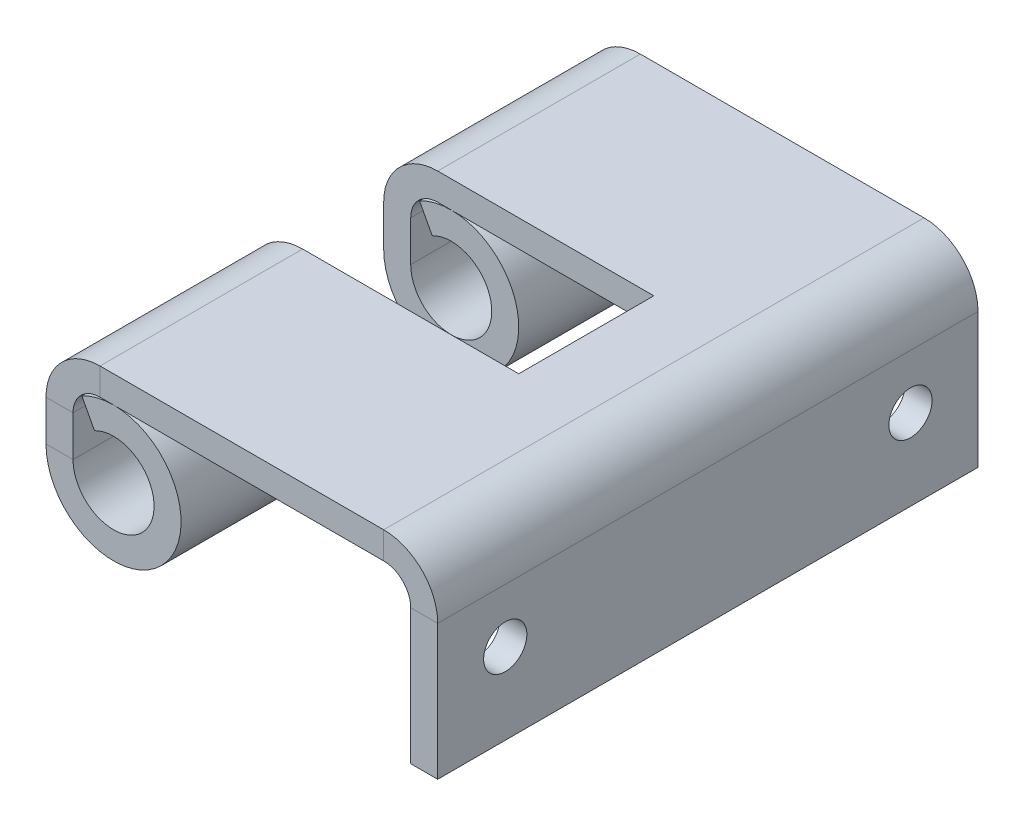
ISO-10303-21;
HEADER;
FILE_DESCRIPTION(('STEP AP214'),'2;1');
FILE_NAME('part.step','',(''),(''),'','','');
FILE_SCHEMA(('AUTOMOTIVE_DESIGN { 1 0 10303 214 1 1 1 1 }'));
ENDSEC;
DATA;
#1=APPLICATION_CONTEXT('core data for automotive mechanical design processes');
#2=APPLICATION_PROTOCOL_DEFINITION('international standard','automotive_design',2000,#1);
#3=PRODUCT_CONTEXT('',#1,'mechanical');
#4=PRODUCT('Part','Part','',(#3));
#5=PRODUCT_RELATED_PRODUCT_CATEGORY('part','',(#4));
#6=PRODUCT_DEFINITION_FORMATION('','',#4);
#7=PRODUCT_DEFINITION_CONTEXT('part definition',#1,'design');
#8=PRODUCT_DEFINITION('design','',#6,#7);
#9=PRODUCT_DEFINITION_SHAPE('','',#8);
#10=(LENGTH_UNIT() NAMED_UNIT(*) SI_UNIT(.MILLI.,.METRE.));
#11=(NAMED_UNIT(*) PLANE_ANGLE_UNIT() SI_UNIT($,.RADIAN.));
#12=(NAMED_UNIT(*) SI_UNIT($,.STERADIAN.) SOLID_ANGLE_UNIT());
#13=UNCERTAINTY_MEASURE_WITH_UNIT(LENGTH_MEASURE(1.E-05),#10,'distance_accuracy_value','');
#14=(GEOMETRIC_REPRESENTATION_CONTEXT(3) GLOBAL_UNCERTAINTY_ASSIGNED_CONTEXT((#13)) GLOBAL_UNIT_ASSIGNED_CONTEXT((#10,
#11,#12)) REPRESENTATION_CONTEXT('',''));
#15=CARTESIAN_POINT('',(0.,0.,0.));
#16=DIRECTION('',(0.,0.,1.));
#17=DIRECTION('',(1.,0.,0.));
#18=AXIS2_PLACEMENT_3D('',#15,#16,#17);
#19=CARTESIAN_POINT('',(-14.5000000000949,7.000000000004,20.));
#20=DIRECTION('',(1.,0.,0.));
#21=DIRECTION('',(0.,0.,-1.));
#22=AXIS2_PLACEMENT_3D('',#19,#20,#21);
#23=PLANE('',#22);
#24=DIRECTION('',(0.,1.,0.));
#25=VECTOR('',#24,1.);
#26=CARTESIAN_POINT('',(-14.5000000000949,-2.999999999996,7.5));
#27=LINE('',#26,#25);
#28=CARTESIAN_POINT('',(-14.5000000000949,3.500000000002,7.5));
#29=VERTEX_POINT('',#28);
#30=CARTESIAN_POINT('',(-14.5000000000949,5.000000000004,7.5));
#31=VERTEX_POINT('',#30);
#32=EDGE_CURVE('E208',#29,#31,#27,.T.);
#33=ORIENTED_EDGE('',*,*,#32,.T.);
#34=DIRECTION('',(0.,0.,-1.));
#35=VECTOR('',#34,1.);
#36=CARTESIAN_POINT('',(-14.5000000000949,5.000000000004,20.));
#37=LINE('',#36,#35);
#38=CARTESIAN_POINT('',(-14.5000000000949,5.000000000004,0.));
#39=VERTEX_POINT('',#38);
#40=EDGE_CURVE('E334',#31,#39,#37,.T.);
#41=ORIENTED_EDGE('',*,*,#40,.T.);
#42=DIRECTION('',(0.,-1.,0.));
#43=VECTOR('',#42,1.);
#44=CARTESIAN_POINT('',(-14.5000000000949,7.000000000004,0.));
#45=LINE('',#44,#43);
#46=CARTESIAN_POINT('',(-14.5000000000949,3.500000000002,0.));
#47=VERTEX_POINT('',#46);
#48=EDGE_CURVE('E298',#39,#47,#45,.T.);
#49=ORIENTED_EDGE('',*,*,#48,.T.);
#50=DIRECTION('',(0.,0.,-1.));
#51=VECTOR('',#50,1.);
#52=CARTESIAN_POINT('',(-14.5000000000949,3.500000000002,0.));
#53=LINE('',#52,#51);
#54=EDGE_CURVE('E263',#47,#29,#53,.F.);
#55=ORIENTED_EDGE('',*,*,#54,.T.);
#56=EDGE_LOOP('',(#33,#41,#49,#55));
#57=FACE_BOUND('',#56,.T.);
#58=ADVANCED_FACE('F36',(#57),#23,.F.);
#59=CARTESIAN_POINT('',(-13.5000000000949,7.000000000004,20.));
#60=DIRECTION('',(1.,0.,0.));
#61=DIRECTION('',(0.,0.,-1.));
#62=AXIS2_PLACEMENT_3D('',#59,#60,#61);
#63=PLANE('',#62);
#64=DIRECTION('',(0.,0.,-1.));
#65=VECTOR('',#64,1.);
#66=CARTESIAN_POINT('',(-13.5000000000949,5.000000000004,20.));
#67=LINE('',#66,#65);
#68=CARTESIAN_POINT('',(-13.5000000000949,5.000000000004,7.5));
#69=VERTEX_POINT('',#68);
#70=CARTESIAN_POINT('',(-13.5000000000949,5.000000000004,0.));
#71=VERTEX_POINT('',#70);
#72=EDGE_CURVE('E389',#69,#71,#67,.T.);
#73=ORIENTED_EDGE('',*,*,#72,.F.);
#74=DIRECTION('',(0.,-1.,0.));
#75=VECTOR('',#74,1.);
#76=CARTESIAN_POINT('',(-13.5000000000949,7.000000000004,7.5));
#77=LINE('',#76,#75);
#78=CARTESIAN_POINT('',(-13.5000000000949,3.500000000002,7.5));
#79=VERTEX_POINT('',#78);
#80=EDGE_CURVE('E235',#69,#79,#77,.T.);
#81=ORIENTED_EDGE('',*,*,#80,.T.);
#82=DIRECTION('',(0.,0.,-1.));
#83=VECTOR('',#82,1.);
#84=CARTESIAN_POINT('',(-13.5000000000949,3.500000000002,0.));
#85=LINE('',#84,#83);
#86=CARTESIAN_POINT('',(-13.5000000000949,3.500000000002,0.));
#87=VERTEX_POINT('',#86);
#88=EDGE_CURVE('E280',#87,#79,#85,.F.);
#89=ORIENTED_EDGE('',*,*,#88,.F.);
#90=DIRECTION('',(0.,1.,0.));
#91=VECTOR('',#90,1.);
#92=CARTESIAN_POINT('',(-13.5000000000949,7.000000000004,0.));
#93=LINE('',#92,#91);
#94=EDGE_CURVE('E336',#71,#87,#93,.F.);
#95=ORIENTED_EDGE('',*,*,#94,.F.);
#96=EDGE_LOOP('',(#73,#81,#89,#95));
#97=FACE_BOUND('',#96,.T.);
#98=ADVANCED_FACE('F415',(#97),#63,.T.);
#99=CARTESIAN_POINT('',(-12.5000000000949,5.000000000004,20.));
#100=DIRECTION('',(0.,0.,-1.));
#101=DIRECTION('',(-1.,0.,0.));
#102=AXIS2_PLACEMENT_3D('',#99,#100,#101);
#103=CYLINDRICAL_SURFACE('',#102,1.);
#104=DIRECTION('',(0.,0.,-1.));
#105=VECTOR('',#104,1.);
#106=CARTESIAN_POINT('',(-12.5000000000949,6.000000000004,20.));
#107=LINE('',#106,#105);
#108=CARTESIAN_POINT('',(-12.5000000000949,6.000000000004,7.5));
#109=VERTEX_POINT('',#108);
#110=CARTESIAN_POINT('',(-12.5000000000949,6.000000000004,0.));
#111=VERTEX_POINT('',#110);
#112=EDGE_CURVE('E385',#109,#111,#107,.T.);
#113=ORIENTED_EDGE('',*,*,#112,.F.);
#114=CARTESIAN_POINT('',(-12.5000000000949,5.000000000004,7.5));
#115=DIRECTION('',(0.,0.,1.));
#116=DIRECTION('',(1.,0.,0.));
#117=AXIS2_PLACEMENT_3D('',#114,#115,#116);
#118=CIRCLE('',#117,1.);
#119=EDGE_CURVE('E241',#109,#69,#118,.T.);
#120=ORIENTED_EDGE('',*,*,#119,.T.);
#121=ORIENTED_EDGE('',*,*,#72,.T.);
#122=CARTESIAN_POINT('',(-12.5000000000949,5.000000000004,0.));
#123=DIRECTION('',(0.,0.,1.));
#124=DIRECTION('',(1.,0.,0.));
#125=AXIS2_PLACEMENT_3D('',#122,#123,#124);
#126=CIRCLE('',#125,1.);
#127=EDGE_CURVE('E338',#111,#71,#126,.T.);
#128=ORIENTED_EDGE('',*,*,#127,.F.);
#129=EDGE_LOOP('',(#113,#120,#121,#128));
#130=FACE_BOUND('',#129,.T.);
#131=ADVANCED_FACE('F438',(#130),#103,.F.);
#132=CARTESIAN_POINT('',(-12.5000000000949,5.000000000004,20.));
#133=DIRECTION('',(0.,0.,-1.));
#134=DIRECTION('',(-1.,0.,0.));
#135=AXIS2_PLACEMENT_3D('',#132,#133,#134);
#136=CYLINDRICAL_SURFACE('',#135,2.);
#137=CARTESIAN_POINT('',(-12.5000000000949,5.000000000004,7.5));
#138=DIRECTION('',(0.,0.,1.));
#139=DIRECTION('',(1.,0.,0.));
#140=AXIS2_PLACEMENT_3D('',#137,#138,#139);
#141=CIRCLE('',#140,2.);
#142=CARTESIAN_POINT('',(-12.5000000000949,7.000000000004,7.5));
#143=VERTEX_POINT('',#142);
#144=EDGE_CURVE('E245',#143,#31,#141,.T.);
#145=ORIENTED_EDGE('',*,*,#144,.F.);
#146=DIRECTION('',(0.,0.,-1.));
#147=VECTOR('',#146,1.);
#148=CARTESIAN_POINT('',(-12.5000000000949,7.000000000004,20.));
#149=LINE('',#148,#147);
#150=CARTESIAN_POINT('',(-12.5000000000949,7.000000000004,0.));
#151=VERTEX_POINT('',#150);
#152=EDGE_CURVE('E224',#143,#151,#149,.T.);
#153=ORIENTED_EDGE('',*,*,#152,.T.);
#154=CARTESIAN_POINT('',(-12.5000000000949,5.000000000004,0.));
#155=DIRECTION('',(0.,0.,-1.));
#156=DIRECTION('',(-1.,0.,0.));
#157=AXIS2_PLACEMENT_3D('',#154,#155,#156);
#158=CIRCLE('',#157,2.);
#159=EDGE_CURVE('E304',#151,#39,#158,.F.);
#160=ORIENTED_EDGE('',*,*,#159,.T.);
#161=ORIENTED_EDGE('',*,*,#40,.F.);
#162=EDGE_LOOP('',(#145,#153,#160,#161));
#163=FACE_BOUND('',#162,.T.);
#164=ADVANCED_FACE('F539',(#163),#136,.T.);
#165=CARTESIAN_POINT('',(-12.7042073442737,4.82442138929038,10.));
#166=DIRECTION('',(0.882947592858922,0.469471562785901,0.));
#167=DIRECTION('',(0.,0.,-1.));
#168=AXIS2_PLACEMENT_3D('',#165,#166,#167);
#169=PLANE('',#168);
#170=DIRECTION('',(0.,0.,-1.));
#171=VECTOR('',#170,1.);
#172=CARTESIAN_POINT('',(-12.7042073442737,4.82442138929038,0.));
#173=LINE('',#172,#171);
#174=CARTESIAN_POINT('',(-12.7042073442737,4.82442138929038,7.5));
#175=VERTEX_POINT('',#174);
#176=CARTESIAN_POINT('',(-12.7042073442737,4.82442138929038,0.));
#177=VERTEX_POINT('',#176);
#178=EDGE_CURVE('E262',#175,#177,#173,.T.);
#179=ORIENTED_EDGE('',*,*,#178,.F.);
#180=DIRECTION('',(0.469471562785901,-0.882947592858922,0.));
#181=VECTOR('',#180,1.);
#182=CARTESIAN_POINT('',(-12.7042073442737,4.82442138929038,7.5));
#183=LINE('',#182,#181);
#184=CARTESIAN_POINT('',(-13.1736789070596,5.70736898214931,7.5));
#185=VERTEX_POINT('',#184);
#186=EDGE_CURVE('E52',#175,#185,#183,.F.);
#187=ORIENTED_EDGE('',*,*,#186,.T.);
#188=DIRECTION('',(0.,0.,-1.));
#189=VECTOR('',#188,1.);
#190=CARTESIAN_POINT('',(-13.1736789070596,5.70736898214931,0.));
#191=LINE('',#190,#189);
#192=CARTESIAN_POINT('',(-13.1736789070596,5.70736898214931,0.));
#193=VERTEX_POINT('',#192);
#194=EDGE_CURVE('E274',#185,#193,#191,.T.);
#195=ORIENTED_EDGE('',*,*,#194,.T.);
#196=DIRECTION('',(-0.469471562785901,0.882947592858922,0.));
#197=VECTOR('',#196,1.);
#198=CARTESIAN_POINT('',(-12.7042073442737,4.82442138929038,0.));
#199=LINE('',#198,#197);
#200=EDGE_CURVE('E295',#177,#193,#199,.T.);
#201=ORIENTED_EDGE('',*,*,#200,.F.);
#202=EDGE_LOOP('',(#179,#187,#195,#201));
#203=FACE_BOUND('',#202,.T.);
#204=ADVANCED_FACE('F569',(#203),#169,.F.);
#205=CARTESIAN_POINT('',(-12.0000000000949,3.500000000002,0.));
#206=DIRECTION('',(0.,0.,-1.));
#207=DIRECTION('',(-0.469471562785901,0.882947592858921,0.));
#208=AXIS2_PLACEMENT_3D('',#205,#206,#207);
#209=CYLINDRICAL_SURFACE('',#208,2.5);
#210=ORIENTED_EDGE('',*,*,#194,.F.);
#211=CARTESIAN_POINT('',(-12.0000000000949,3.500000000002,7.5));
#212=DIRECTION('',(0.,0.,1.));
#213=DIRECTION('',(1.,0.,0.));
#214=AXIS2_PLACEMENT_3D('',#211,#212,#213);
#215=CIRCLE('',#214,2.5);
#216=EDGE_CURVE('E238',#185,#29,#215,.F.);
#217=ORIENTED_EDGE('',*,*,#216,.T.);
#218=ORIENTED_EDGE('',*,*,#54,.F.);
#219=CARTESIAN_POINT('',(-12.0000000000949,3.500000000002,0.));
#220=DIRECTION('',(0.,0.,-1.));
#221=DIRECTION('',(-1.,0.,0.));
#222=AXIS2_PLACEMENT_3D('',#219,#220,#221);
#223=CIRCLE('',#222,2.5);
#224=EDGE_CURVE('E273',#193,#47,#223,.T.);
#225=ORIENTED_EDGE('',*,*,#224,.F.);
#226=EDGE_LOOP('',(#210,#217,#218,#225));
#227=FACE_BOUND('',#226,.T.);
#228=ADVANCED_FACE('F426',(#227),#209,.T.);
#229=CARTESIAN_POINT('',(-12.0000000000949,3.500000000002,0.));
#230=DIRECTION('',(0.,0.,-1.));
#231=DIRECTION('',(-0.469471562785901,0.882947592858921,0.));
#232=AXIS2_PLACEMENT_3D('',#229,#230,#231);
#233=CYLINDRICAL_SURFACE('',#232,1.5);
#234=CARTESIAN_POINT('',(-12.0000000000949,3.500000000002,7.5));
#235=DIRECTION('',(0.,0.,1.));
#236=DIRECTION('',(1.,0.,0.));
#237=AXIS2_PLACEMENT_3D('',#234,#235,#236);
#238=CIRCLE('',#237,1.5);
#239=EDGE_CURVE('E45',#175,#79,#238,.F.);
#240=ORIENTED_EDGE('',*,*,#239,.F.);
#241=ORIENTED_EDGE('',*,*,#178,.T.);
#242=CARTESIAN_POINT('',(-12.0000000000949,3.500000000002,0.));
#243=DIRECTION('',(0.,0.,-1.));
#244=DIRECTION('',(-1.,0.,0.));
#245=AXIS2_PLACEMENT_3D('',#242,#243,#244);
#246=CIRCLE('',#245,1.5);
#247=EDGE_CURVE('E284',#177,#87,#246,.T.);
#248=ORIENTED_EDGE('',*,*,#247,.T.);
#249=ORIENTED_EDGE('',*,*,#88,.T.);
#250=EDGE_LOOP('',(#240,#241,#248,#249));
#251=FACE_BOUND('',#250,.T.);
#252=ADVANCED_FACE('F417',(#251),#233,.F.);
#253=CARTESIAN_POINT('',(-12.5000000000949,6.000000000004,0.));
#254=DIRECTION('',(0.,0.,-1.));
#255=DIRECTION('',(-1.,0.,0.));
#256=AXIS2_PLACEMENT_3D('',#253,#254,#255);
#257=PLANE('',#256);
#258=ORIENTED_EDGE('',*,*,#94,.T.);
#259=DIRECTION('',(-1.,0.,0.));
#260=VECTOR('',#259,1.);
#261=CARTESIAN_POINT('',(-13.5000000000949,3.500000000002,0.));
#262=LINE('',#261,#260);
#263=EDGE_CURVE('E60',#87,#47,#262,.T.);
#264=ORIENTED_EDGE('',*,*,#263,.T.);
#265=ORIENTED_EDGE('',*,*,#48,.F.);
#266=DIRECTION('',(1.,0.,0.));
#267=VECTOR('',#266,1.);
#268=CARTESIAN_POINT('',(-14.5000000000949,5.000000000004,0.));
#269=LINE('',#268,#267);
#270=EDGE_CURVE('E396',#39,#71,#269,.T.);
#271=ORIENTED_EDGE('',*,*,#270,.T.);
#272=EDGE_LOOP('',(#258,#264,#265,#271));
#273=FACE_BOUND('',#272,.T.);
#274=ADVANCED_FACE('F430',(#273),#257,.T.);
#275=CARTESIAN_POINT('',(0.,5.000000000004,20.));
#276=DIRECTION('',(0.,0.,1.));
#277=DIRECTION('',(1.,0.,0.));
#278=AXIS2_PLACEMENT_3D('',#275,#276,#277);
#279=PLANE('',#278);
#280=DIRECTION('',(-1.,0.,0.));
#281=VECTOR('',#280,1.);
#282=CARTESIAN_POINT('',(0.,5.000000000004,20.));
#283=LINE('',#282,#281);
#284=CARTESIAN_POINT('',(0.,5.000000000004,20.));
#285=VERTEX_POINT('',#284);
#286=CARTESIAN_POINT('',(-1.,5.000000000004,20.));
#287=VERTEX_POINT('',#286);
#288=EDGE_CURVE('E409',#285,#287,#283,.T.);
#289=ORIENTED_EDGE('',*,*,#288,.F.);
#290=CARTESIAN_POINT('',(-2.,5.000000000004,20.));
#291=DIRECTION('',(0.,0.,-1.));
#292=DIRECTION('',(-1.,0.,0.));
#293=AXIS2_PLACEMENT_3D('',#290,#291,#292);
#294=CIRCLE('',#293,2.);
#295=CARTESIAN_POINT('',(-2.,7.000000000004,20.));
#296=VERTEX_POINT('',#295);
#297=EDGE_CURVE('E325',#285,#296,#294,.F.);
#298=ORIENTED_EDGE('',*,*,#297,.T.);
#299=DIRECTION('',(0.,1.,0.));
#300=VECTOR('',#299,1.);
#301=CARTESIAN_POINT('',(-2.,6.000000000004,20.));
#302=LINE('',#301,#300);
#303=CARTESIAN_POINT('',(-2.,6.000000000004,20.));
#304=VERTEX_POINT('',#303);
#305=EDGE_CURVE('E407',#304,#296,#302,.T.);
#306=ORIENTED_EDGE('',*,*,#305,.F.);
#307=CARTESIAN_POINT('',(-2.,5.000000000004,20.));
#308=DIRECTION('',(0.,0.,1.));
#309=DIRECTION('',(1.,0.,0.));
#310=AXIS2_PLACEMENT_3D('',#307,#308,#309);
#311=CIRCLE('',#310,1.);
#312=EDGE_CURVE('E313',#287,#304,#311,.T.);
#313=ORIENTED_EDGE('',*,*,#312,.F.);
#314=EDGE_LOOP('',(#289,#298,#306,#313));
#315=FACE_BOUND('',#314,.T.);
#316=ADVANCED_FACE('F38',(#315),#279,.T.);
#317=CARTESIAN_POINT('',(-2.,6.000000000004,20.));
#318=DIRECTION('',(0.,0.,1.));
#319=DIRECTION('',(1.,0.,0.));
#320=AXIS2_PLACEMENT_3D('',#317,#318,#319);
#321=PLANE('',#320);
#322=DIRECTION('',(0.,1.,0.));
#323=VECTOR('',#322,1.);
#324=CARTESIAN_POINT('',(0.,0.,20.));
#325=LINE('',#324,#323);
#326=CARTESIAN_POINT('',(0.,0.,20.));
#327=VERTEX_POINT('',#326);
#328=EDGE_CURVE('E322',#327,#285,#325,.T.);
#329=ORIENTED_EDGE('',*,*,#328,.T.);
#330=ORIENTED_EDGE('',*,*,#288,.T.);
#331=DIRECTION('',(0.,1.,0.));
#332=VECTOR('',#331,1.);
#333=CARTESIAN_POINT('',(-1.,0.,20.));
#334=LINE('',#333,#332);
#335=CARTESIAN_POINT('',(-1.,0.,20.));
#336=VERTEX_POINT('',#335);
#337=EDGE_CURVE('E316',#336,#287,#334,.T.);
#338=ORIENTED_EDGE('',*,*,#337,.F.);
#339=DIRECTION('',(-1.,0.,0.));
#340=VECTOR('',#339,1.);
#341=CARTESIAN_POINT('',(0.,0.,20.));
#342=LINE('',#341,#340);
#343=EDGE_CURVE('E319',#327,#336,#342,.T.);
#344=ORIENTED_EDGE('',*,*,#343,.F.);
#345=EDGE_LOOP('',(#329,#330,#338,#344));
#346=FACE_BOUND('',#345,.T.);
#347=ADVANCED_FACE('F466',(#346),#321,.T.);
#348=CARTESIAN_POINT('',(-2.,7.000000000004,0.));
#349=DIRECTION('',(0.,0.,-1.));
#350=DIRECTION('',(-1.,0.,0.));
#351=AXIS2_PLACEMENT_3D('',#348,#349,#350);
#352=PLANE('',#351);
#353=DIRECTION('',(0.,-1.,0.));
#354=VECTOR('',#353,1.);
#355=CARTESIAN_POINT('',(-2.,7.000000000004,0.));
#356=LINE('',#355,#354);
#357=CARTESIAN_POINT('',(-2.,7.000000000004,0.));
#358=VERTEX_POINT('',#357);
#359=CARTESIAN_POINT('',(-2.,6.000000000004,0.));
#360=VERTEX_POINT('',#359);
#361=EDGE_CURVE('E405',#358,#360,#356,.T.);
#362=ORIENTED_EDGE('',*,*,#361,.F.);
#363=CARTESIAN_POINT('',(-2.,5.000000000004,0.));
#364=DIRECTION('',(0.,0.,-1.));
#365=DIRECTION('',(-1.,0.,0.));
#366=AXIS2_PLACEMENT_3D('',#363,#364,#365);
#367=CIRCLE('',#366,2.);
#368=CARTESIAN_POINT('',(0.,5.000000000004,0.));
#369=VERTEX_POINT('',#368);
#370=EDGE_CURVE('E356',#369,#358,#367,.F.);
#371=ORIENTED_EDGE('',*,*,#370,.F.);
#372=DIRECTION('',(1.,0.,0.));
#373=VECTOR('',#372,1.);
#374=CARTESIAN_POINT('',(-1.,5.000000000004,0.));
#375=LINE('',#374,#373);
#376=CARTESIAN_POINT('',(-1.,5.000000000004,0.));
#377=VERTEX_POINT('',#376);
#378=EDGE_CURVE('E403',#377,#369,#375,.T.);
#379=ORIENTED_EDGE('',*,*,#378,.F.);
#380=CARTESIAN_POINT('',(-2.,5.000000000004,0.));
#381=DIRECTION('',(0.,0.,1.));
#382=DIRECTION('',(1.,0.,0.));
#383=AXIS2_PLACEMENT_3D('',#380,#381,#382);
#384=CIRCLE('',#383,1.);
#385=EDGE_CURVE('E344',#377,#360,#384,.T.);
#386=ORIENTED_EDGE('',*,*,#385,.T.);
#387=EDGE_LOOP('',(#362,#371,#379,#386));
#388=FACE_BOUND('',#387,.T.);
#389=ADVANCED_FACE('F450',(#388),#352,.T.);
#390=CARTESIAN_POINT('',(-1.,5.000000000004,0.));
#391=DIRECTION('',(0.,0.,-1.));
#392=DIRECTION('',(-1.,0.,0.));
#393=AXIS2_PLACEMENT_3D('',#390,#391,#392);
#394=PLANE('',#393);
#395=DIRECTION('',(-1.,0.,0.));
#396=VECTOR('',#395,1.);
#397=CARTESIAN_POINT('',(0.,7.000000000004,0.));
#398=LINE('',#397,#396);
#399=EDGE_CURVE('E359',#358,#151,#398,.T.);
#400=ORIENTED_EDGE('',*,*,#399,.F.);
#401=ORIENTED_EDGE('',*,*,#361,.T.);
#402=DIRECTION('',(-1.,0.,0.));
#403=VECTOR('',#402,1.);
#404=CARTESIAN_POINT('',(0.,6.000000000004,0.));
#405=LINE('',#404,#403);
#406=EDGE_CURVE('E341',#360,#111,#405,.T.);
#407=ORIENTED_EDGE('',*,*,#406,.T.);
#408=DIRECTION('',(0.,1.,0.));
#409=VECTOR('',#408,1.);
#410=CARTESIAN_POINT('',(-12.5000000000949,6.000000000004,0.));
#411=LINE('',#410,#409);
#412=EDGE_CURVE('E393',#111,#151,#411,.T.);
#413=ORIENTED_EDGE('',*,*,#412,.T.);
#414=EDGE_LOOP('',(#400,#401,#407,#413));
#415=FACE_BOUND('',#414,.T.);
#416=ADVANCED_FACE('F442',(#415),#394,.T.);
#417=CARTESIAN_POINT('',(-12.5000000000949,7.000000000004,20.));
#418=DIRECTION('',(0.,0.,1.));
#419=DIRECTION('',(1.,0.,0.));
#420=AXIS2_PLACEMENT_3D('',#417,#418,#419);
#421=PLANE('',#420);
#422=DIRECTION('',(0.,-1.,0.));
#423=VECTOR('',#422,1.);
#424=CARTESIAN_POINT('',(-12.5000000000949,7.000000000004,20.));
#425=LINE('',#424,#423);
#426=CARTESIAN_POINT('',(-12.5000000000949,7.000000000004,20.));
#427=VERTEX_POINT('',#426);
#428=CARTESIAN_POINT('',(-12.5000000000949,6.000000000004,20.));
#429=VERTEX_POINT('',#428);
#430=EDGE_CURVE('E401',#427,#429,#425,.T.);
#431=ORIENTED_EDGE('',*,*,#430,.F.);
#432=CARTESIAN_POINT('',(-12.5000000000949,5.000000000004,20.));
#433=DIRECTION('',(0.,0.,-1.));
#434=DIRECTION('',(-1.,0.,0.));
#435=AXIS2_PLACEMENT_3D('',#432,#433,#434);
#436=CIRCLE('',#435,2.);
#437=CARTESIAN_POINT('',(-14.5000000000949,5.000000000004,20.));
#438=VERTEX_POINT('',#437);
#439=EDGE_CURVE('E331',#427,#438,#436,.F.);
#440=ORIENTED_EDGE('',*,*,#439,.T.);
#441=DIRECTION('',(-1.,0.,0.));
#442=VECTOR('',#441,1.);
#443=CARTESIAN_POINT('',(-13.5000000000949,5.000000000004,20.));
#444=LINE('',#443,#442);
#445=CARTESIAN_POINT('',(-13.5000000000949,5.000000000004,20.));
#446=VERTEX_POINT('',#445);
#447=EDGE_CURVE('E399',#446,#438,#444,.T.);
#448=ORIENTED_EDGE('',*,*,#447,.F.);
#449=CARTESIAN_POINT('',(-12.5000000000949,5.000000000004,20.));
#450=DIRECTION('',(0.,0.,1.));
#451=DIRECTION('',(1.,0.,0.));
#452=AXIS2_PLACEMENT_3D('',#449,#450,#451);
#453=CIRCLE('',#452,1.);
#454=EDGE_CURVE('E307',#429,#446,#453,.T.);
#455=ORIENTED_EDGE('',*,*,#454,.F.);
#456=EDGE_LOOP('',(#431,#440,#448,#455));
#457=FACE_BOUND('',#456,.T.);
#458=ADVANCED_FACE('F488',(#457),#421,.T.);
#459=CARTESIAN_POINT('',(-13.5000000000949,5.000000000004,20.));
#460=DIRECTION('',(0.,0.,1.));
#461=DIRECTION('',(1.,0.,0.));
#462=AXIS2_PLACEMENT_3D('',#459,#460,#461);
#463=PLANE('',#462);
#464=DIRECTION('',(-1.,0.,0.));
#465=VECTOR('',#464,1.);
#466=CARTESIAN_POINT('',(0.,7.000000000004,20.));
#467=LINE('',#466,#465);
#468=EDGE_CURVE('E328',#296,#427,#467,.T.);
#469=ORIENTED_EDGE('',*,*,#468,.T.);
#470=ORIENTED_EDGE('',*,*,#430,.T.);
#471=DIRECTION('',(-1.,0.,0.));
#472=VECTOR('',#471,1.);
#473=CARTESIAN_POINT('',(0.,6.000000000004,20.));
#474=LINE('',#473,#472);
#475=EDGE_CURVE('E310',#304,#429,#474,.T.);
#476=ORIENTED_EDGE('',*,*,#475,.F.);
#477=ORIENTED_EDGE('',*,*,#305,.T.);
#478=EDGE_LOOP('',(#469,#470,#476,#477));
#479=FACE_BOUND('',#478,.T.);
#480=ADVANCED_FACE('F480',(#479),#463,.T.);
#481=CARTESIAN_POINT('',(-14.5000000000949,5.000000000004,0.));
#482=DIRECTION('',(0.,0.,-1.));
#483=DIRECTION('',(-1.,0.,0.));
#484=AXIS2_PLACEMENT_3D('',#481,#482,#483);
#485=PLANE('',#484);
#486=ORIENTED_EDGE('',*,*,#270,.F.);
#487=ORIENTED_EDGE('',*,*,#159,.F.);
#488=ORIENTED_EDGE('',*,*,#412,.F.);
#489=ORIENTED_EDGE('',*,*,#127,.T.);
#490=EDGE_LOOP('',(#486,#487,#488,#489));
#491=FACE_BOUND('',#490,.T.);
#492=ADVANCED_FACE('F435',(#491),#485,.T.);
#493=CARTESIAN_POINT('',(-14.5000000000949,5.000000000004,12.5));
#494=VERTEX_POINT('',#493);
#495=EDGE_CURVE('E363',#438,#494,#37,.T.);
#496=ORIENTED_EDGE('',*,*,#495,.T.);
#497=DIRECTION('',(0.,1.,0.));
#498=VECTOR('',#497,1.);
#499=CARTESIAN_POINT('',(-14.5000000000949,-2.999999999996,12.5));
#500=LINE('',#499,#498);
#501=CARTESIAN_POINT('',(-14.5000000000949,3.500000000002,12.5));
#502=VERTEX_POINT('',#501);
#503=EDGE_CURVE('E230',#502,#494,#500,.T.);
#504=ORIENTED_EDGE('',*,*,#503,.F.);
#505=CARTESIAN_POINT('',(-14.5000000000949,3.500000000002,20.));
#506=VERTEX_POINT('',#505);
#507=EDGE_CURVE('E267',#502,#506,#53,.F.);
#508=ORIENTED_EDGE('',*,*,#507,.T.);
#509=DIRECTION('',(0.,-1.,0.));
#510=VECTOR('',#509,1.);
#511=CARTESIAN_POINT('',(-14.5000000000949,7.000000000004,20.));
#512=LINE('',#511,#510);
#513=EDGE_CURVE('E300',#438,#506,#512,.T.);
#514=ORIENTED_EDGE('',*,*,#513,.F.);
#515=EDGE_LOOP('',(#496,#504,#508,#514));
#516=FACE_BOUND('',#515,.T.);
#517=ADVANCED_FACE('F522',(#516),#23,.F.);
#518=DIRECTION('',(0.,-1.,0.));
#519=VECTOR('',#518,1.);
#520=CARTESIAN_POINT('',(-13.5000000000949,7.000000000004,12.5));
#521=LINE('',#520,#519);
#522=CARTESIAN_POINT('',(-13.5000000000949,5.000000000004,12.5));
#523=VERTEX_POINT('',#522);
#524=CARTESIAN_POINT('',(-13.5000000000949,3.500000000002,12.5));
#525=VERTEX_POINT('',#524);
#526=EDGE_CURVE('E249',#523,#525,#521,.T.);
#527=ORIENTED_EDGE('',*,*,#526,.F.);
#528=EDGE_CURVE('E390',#446,#523,#67,.T.);
#529=ORIENTED_EDGE('',*,*,#528,.F.);
#530=DIRECTION('',(0.,1.,0.));
#531=VECTOR('',#530,1.);
#532=CARTESIAN_POINT('',(-13.5000000000949,7.000000000004,20.));
#533=LINE('',#532,#531);
#534=CARTESIAN_POINT('',(-13.5000000000949,3.500000000002,20.));
#535=VERTEX_POINT('',#534);
#536=EDGE_CURVE('E303',#446,#535,#533,.F.);
#537=ORIENTED_EDGE('',*,*,#536,.T.);
#538=EDGE_CURVE('E283',#525,#535,#85,.F.);
#539=ORIENTED_EDGE('',*,*,#538,.F.);
#540=EDGE_LOOP('',(#527,#529,#537,#539));
#541=FACE_BOUND('',#540,.T.);
#542=ADVANCED_FACE('F496',(#541),#63,.T.);
#543=CARTESIAN_POINT('',(-12.5000000000949,5.000000000004,12.5));
#544=DIRECTION('',(0.,0.,1.));
#545=DIRECTION('',(1.,0.,0.));
#546=AXIS2_PLACEMENT_3D('',#543,#544,#545);
#547=CIRCLE('',#546,1.);
#548=CARTESIAN_POINT('',(-12.5000000000949,6.000000000004,12.5));
#549=VERTEX_POINT('',#548);
#550=EDGE_CURVE('E253',#549,#523,#547,.T.);
#551=ORIENTED_EDGE('',*,*,#550,.F.);
#552=EDGE_CURVE('E386',#429,#549,#107,.T.);
#553=ORIENTED_EDGE('',*,*,#552,.F.);
#554=ORIENTED_EDGE('',*,*,#454,.T.);
#555=ORIENTED_EDGE('',*,*,#528,.T.);
#556=EDGE_LOOP('',(#551,#553,#554,#555));
#557=FACE_BOUND('',#556,.T.);
#558=ADVANCED_FACE('F486',(#557),#103,.F.);
#559=CARTESIAN_POINT('',(0.,6.000000000004,20.));
#560=DIRECTION('',(0.,-1.,0.));
#561=DIRECTION('',(1.,0.,0.));
#562=AXIS2_PLACEMENT_3D('',#559,#560,#561);
#563=PLANE('',#562);
#564=DIRECTION('',(-1.,0.,0.));
#565=VECTOR('',#564,1.);
#566=CARTESIAN_POINT('',(0.,6.000000000004,12.5));
#567=LINE('',#566,#565);
#568=CARTESIAN_POINT('',(-4.50000000009485,6.000000000004,12.5));
#569=VERTEX_POINT('',#568);
#570=EDGE_CURVE('E255',#569,#549,#567,.T.);
#571=ORIENTED_EDGE('',*,*,#570,.F.);
#572=DIRECTION('',(0.,0.,-1.));
#573=VECTOR('',#572,1.);
#574=CARTESIAN_POINT('',(-4.50000000009485,6.000000000004,20.));
#575=LINE('',#574,#573);
#576=CARTESIAN_POINT('',(-4.50000000009485,6.000000000004,7.5));
#577=VERTEX_POINT('',#576);
#578=EDGE_CURVE('E260',#569,#577,#575,.T.);
#579=ORIENTED_EDGE('',*,*,#578,.T.);
#580=DIRECTION('',(-1.,0.,0.));
#581=VECTOR('',#580,1.);
#582=CARTESIAN_POINT('',(0.,6.000000000004,7.5));
#583=LINE('',#582,#581);
#584=EDGE_CURVE('E205',#577,#109,#583,.T.);
#585=ORIENTED_EDGE('',*,*,#584,.T.);
#586=ORIENTED_EDGE('',*,*,#112,.T.);
#587=ORIENTED_EDGE('',*,*,#406,.F.);
#588=DIRECTION('',(0.,0.,-1.));
#589=VECTOR('',#588,1.);
#590=CARTESIAN_POINT('',(-2.,6.000000000004,20.));
#591=LINE('',#590,#589);
#592=EDGE_CURVE('E382',#304,#360,#591,.T.);
#593=ORIENTED_EDGE('',*,*,#592,.F.);
#594=ORIENTED_EDGE('',*,*,#475,.T.);
#595=ORIENTED_EDGE('',*,*,#552,.T.);
#596=EDGE_LOOP('',(#571,#579,#585,#586,#587,#593,#594,#595));
#597=FACE_BOUND('',#596,.T.);
#598=ADVANCED_FACE('F446',(#597),#563,.T.);
#599=CARTESIAN_POINT('',(-2.,5.000000000004,20.));
#600=DIRECTION('',(0.,0.,-1.));
#601=DIRECTION('',(-1.,0.,0.));
#602=AXIS2_PLACEMENT_3D('',#599,#600,#601);
#603=CYLINDRICAL_SURFACE('',#602,1.);
#604=ORIENTED_EDGE('',*,*,#385,.F.);
#605=DIRECTION('',(0.,0.,-1.));
#606=VECTOR('',#605,1.);
#607=CARTESIAN_POINT('',(-1.,5.000000000004,20.));
#608=LINE('',#607,#606);
#609=EDGE_CURVE('E379',#287,#377,#608,.T.);
#610=ORIENTED_EDGE('',*,*,#609,.F.);
#611=ORIENTED_EDGE('',*,*,#312,.T.);
#612=ORIENTED_EDGE('',*,*,#592,.T.);
#613=EDGE_LOOP('',(#604,#610,#611,#612));
#614=FACE_BOUND('',#613,.T.);
#615=ADVANCED_FACE('F454',(#614),#603,.F.);
#616=CARTESIAN_POINT('',(-1.,0.,20.));
#617=DIRECTION('',(-1.,0.,0.));
#618=DIRECTION('',(0.,0.,1.));
#619=AXIS2_PLACEMENT_3D('',#616,#617,#618);
#620=PLANE('',#619);
#621=CARTESIAN_POINT('',(-1.,3.,2.5));
#622=DIRECTION('',(-1.,0.,0.));
#623=DIRECTION('',(0.,0.,1.));
#624=AXIS2_PLACEMENT_3D('',#621,#622,#623);
#625=CIRCLE('',#624,0.79999999999999);
#626=CARTESIAN_POINT('',(-1.,3.,3.29999999999999));
#627=VERTEX_POINT('',#626);
#628=EDGE_CURVE('E594',#627,#627,#625,.T.);
#629=ORIENTED_EDGE('',*,*,#628,.F.);
#630=EDGE_LOOP('',(#629));
#631=FACE_BOUND('',#630,.T.);
#632=CARTESIAN_POINT('',(-1.,3.,17.5));
#633=DIRECTION('',(-1.,0.,0.));
#634=DIRECTION('',(0.,0.,1.));
#635=AXIS2_PLACEMENT_3D('',#632,#633,#634);
#636=CIRCLE('',#635,0.79999999999999);
#637=CARTESIAN_POINT('',(-1.,3.,18.3));
#638=VERTEX_POINT('',#637);
#639=EDGE_CURVE('E597',#638,#638,#636,.T.);
#640=ORIENTED_EDGE('',*,*,#639,.F.);
#641=EDGE_LOOP('',(#640));
#642=FACE_BOUND('',#641,.T.);
#643=DIRECTION('',(0.,1.,0.));
#644=VECTOR('',#643,1.);
#645=CARTESIAN_POINT('',(-1.,0.,0.));
#646=LINE('',#645,#644);
#647=CARTESIAN_POINT('',(-1.,0.,0.));
#648=VERTEX_POINT('',#647);
#649=EDGE_CURVE('E347',#648,#377,#646,.T.);
#650=ORIENTED_EDGE('',*,*,#649,.F.);
#651=DIRECTION('',(0.,0.,-1.));
#652=VECTOR('',#651,1.);
#653=CARTESIAN_POINT('',(-1.,0.,20.));
#654=LINE('',#653,#652);
#655=EDGE_CURVE('E377',#336,#648,#654,.T.);
#656=ORIENTED_EDGE('',*,*,#655,.F.);
#657=ORIENTED_EDGE('',*,*,#337,.T.);
#658=ORIENTED_EDGE('',*,*,#609,.T.);
#659=EDGE_LOOP('',(#650,#656,#657,#658));
#660=FACE_BOUND('',#659,.T.);
#661=ADVANCED_FACE('F462',(#631,#642,#660),#620,.T.);
#662=CARTESIAN_POINT('',(0.,0.,20.));
#663=DIRECTION('',(0.,-1.,0.));
#664=DIRECTION('',(0.,0.,-1.));
#665=AXIS2_PLACEMENT_3D('',#662,#663,#664);
#666=PLANE('',#665);
#667=DIRECTION('',(-1.,0.,0.));
#668=VECTOR('',#667,1.);
#669=CARTESIAN_POINT('',(0.,0.,0.));
#670=LINE('',#669,#668);
#671=CARTESIAN_POINT('',(0.,0.,0.));
#672=VERTEX_POINT('',#671);
#673=EDGE_CURVE('E350',#672,#648,#670,.T.);
#674=ORIENTED_EDGE('',*,*,#673,.F.);
#675=DIRECTION('',(0.,0.,-1.));
#676=VECTOR('',#675,1.);
#677=CARTESIAN_POINT('',(0.,0.,20.));
#678=LINE('',#677,#676);
#679=EDGE_CURVE('E375',#327,#672,#678,.T.);
#680=ORIENTED_EDGE('',*,*,#679,.F.);
#681=ORIENTED_EDGE('',*,*,#343,.T.);
#682=ORIENTED_EDGE('',*,*,#655,.T.);
#683=EDGE_LOOP('',(#674,#680,#681,#682));
#684=FACE_BOUND('',#683,.T.);
#685=ADVANCED_FACE('F468',(#684),#666,.T.);
#686=CARTESIAN_POINT('',(0.,0.,20.));
#687=DIRECTION('',(-1.,0.,0.));
#688=DIRECTION('',(0.,0.,1.));
#689=AXIS2_PLACEMENT_3D('',#686,#687,#688);
#690=PLANE('',#689);
#691=CARTESIAN_POINT('',(0.,3.,2.5));
#692=DIRECTION('',(-1.,0.,0.));
#693=DIRECTION('',(0.,0.,1.));
#694=AXIS2_PLACEMENT_3D('',#691,#692,#693);
#695=CIRCLE('',#694,0.799999999999989);
#696=CARTESIAN_POINT('',(0.,3.,3.29999999999999));
#697=VERTEX_POINT('',#696);
#698=EDGE_CURVE('E40',#697,#697,#695,.T.);
#699=ORIENTED_EDGE('',*,*,#698,.T.);
#700=EDGE_LOOP('',(#699));
#701=FACE_BOUND('',#700,.T.);
#702=CARTESIAN_POINT('',(0.,3.,17.5));
#703=DIRECTION('',(-1.,0.,0.));
#704=DIRECTION('',(0.,0.,1.));
#705=AXIS2_PLACEMENT_3D('',#702,#703,#704);
#706=CIRCLE('',#705,0.799999999999989);
#707=CARTESIAN_POINT('',(0.,3.,18.3));
#708=VERTEX_POINT('',#707);
#709=EDGE_CURVE('E219',#708,#708,#706,.T.);
#710=ORIENTED_EDGE('',*,*,#709,.T.);
#711=EDGE_LOOP('',(#710));
#712=FACE_BOUND('',#711,.T.);
#713=DIRECTION('',(0.,1.,0.));
#714=VECTOR('',#713,1.);
#715=CARTESIAN_POINT('',(0.,0.,0.));
#716=LINE('',#715,#714);
#717=EDGE_CURVE('E353',#672,#369,#716,.T.);
#718=ORIENTED_EDGE('',*,*,#717,.T.);
#719=DIRECTION('',(0.,0.,-1.));
#720=VECTOR('',#719,1.);
#721=CARTESIAN_POINT('',(0.,5.000000000004,20.));
#722=LINE('',#721,#720);
#723=EDGE_CURVE('E372',#285,#369,#722,.T.);
#724=ORIENTED_EDGE('',*,*,#723,.F.);
#725=ORIENTED_EDGE('',*,*,#328,.F.);
#726=ORIENTED_EDGE('',*,*,#679,.T.);
#727=EDGE_LOOP('',(#718,#724,#725,#726));
#728=FACE_BOUND('',#727,.T.);
#729=ADVANCED_FACE('F472',(#701,#712,#728),#690,.F.);
#730=CARTESIAN_POINT('',(-2.,5.000000000004,20.));
#731=DIRECTION('',(0.,0.,-1.));
#732=DIRECTION('',(-1.,0.,0.));
#733=AXIS2_PLACEMENT_3D('',#730,#731,#732);
#734=CYLINDRICAL_SURFACE('',#733,2.);
#735=ORIENTED_EDGE('',*,*,#370,.T.);
#736=DIRECTION('',(0.,0.,-1.));
#737=VECTOR('',#736,1.);
#738=CARTESIAN_POINT('',(-2.,7.000000000004,20.));
#739=LINE('',#738,#737);
#740=EDGE_CURVE('E369',#296,#358,#739,.T.);
#741=ORIENTED_EDGE('',*,*,#740,.F.);
#742=ORIENTED_EDGE('',*,*,#297,.F.);
#743=ORIENTED_EDGE('',*,*,#723,.T.);
#744=EDGE_LOOP('',(#735,#741,#742,#743));
#745=FACE_BOUND('',#744,.T.);
#746=ADVANCED_FACE('F476',(#745),#734,.T.);
#747=CARTESIAN_POINT('',(0.,7.000000000004,20.));
#748=DIRECTION('',(0.,-1.,0.));
#749=DIRECTION('',(1.,0.,0.));
#750=AXIS2_PLACEMENT_3D('',#747,#748,#749);
#751=PLANE('',#750);
#752=DIRECTION('',(0.,0.,1.));
#753=VECTOR('',#752,1.);
#754=CARTESIAN_POINT('',(-4.50000000009485,7.000000000004,10.));
#755=LINE('',#754,#753);
#756=CARTESIAN_POINT('',(-4.50000000009485,7.000000000004,7.5));
#757=VERTEX_POINT('',#756);
#758=CARTESIAN_POINT('',(-4.50000000009485,7.000000000004,12.5));
#759=VERTEX_POINT('',#758);
#760=EDGE_CURVE('E212',#757,#759,#755,.T.);
#761=ORIENTED_EDGE('',*,*,#760,.T.);
#762=DIRECTION('',(1.,0.,0.));
#763=VECTOR('',#762,1.);
#764=CARTESIAN_POINT('',(-26.7362094444975,7.00000000000399,12.5));
#765=LINE('',#764,#763);
#766=CARTESIAN_POINT('',(-12.5000000000949,7.000000000004,12.5));
#767=VERTEX_POINT('',#766);
#768=EDGE_CURVE('E209',#767,#759,#765,.T.);
#769=ORIENTED_EDGE('',*,*,#768,.F.);
#770=EDGE_CURVE('E366',#427,#767,#149,.T.);
#771=ORIENTED_EDGE('',*,*,#770,.F.);
#772=ORIENTED_EDGE('',*,*,#468,.F.);
#773=ORIENTED_EDGE('',*,*,#740,.T.);
#774=ORIENTED_EDGE('',*,*,#399,.T.);
#775=ORIENTED_EDGE('',*,*,#152,.F.);
#776=DIRECTION('',(1.,0.,0.));
#777=VECTOR('',#776,1.);
#778=CARTESIAN_POINT('',(-26.7362094444975,7.00000000000399,7.5));
#779=LINE('',#778,#777);
#780=EDGE_CURVE('E202',#143,#757,#779,.T.);
#781=ORIENTED_EDGE('',*,*,#780,.T.);
#782=EDGE_LOOP('',(#761,#769,#771,#772,#773,#774,#775,#781));
#783=FACE_BOUND('',#782,.T.);
#784=ADVANCED_FACE('F222',(#783),#751,.F.);
#785=ORIENTED_EDGE('',*,*,#770,.T.);
#786=CARTESIAN_POINT('',(-12.5000000000949,5.000000000004,12.5));
#787=DIRECTION('',(0.,0.,1.));
#788=DIRECTION('',(1.,0.,0.));
#789=AXIS2_PLACEMENT_3D('',#786,#787,#788);
#790=CIRCLE('',#789,2.);
#791=EDGE_CURVE('E257',#767,#494,#790,.T.);
#792=ORIENTED_EDGE('',*,*,#791,.T.);
#793=ORIENTED_EDGE('',*,*,#495,.F.);
#794=ORIENTED_EDGE('',*,*,#439,.F.);
#795=EDGE_LOOP('',(#785,#792,#793,#794));
#796=FACE_BOUND('',#795,.T.);
#797=ADVANCED_FACE('F519',(#796),#136,.T.);
#798=CARTESIAN_POINT('',(-12.5000000000949,5.000000000004,20.));
#799=DIRECTION('',(0.,0.,1.));
#800=DIRECTION('',(1.,0.,0.));
#801=AXIS2_PLACEMENT_3D('',#798,#799,#800);
#802=PLANE('',#801);
#803=DIRECTION('',(-1.,0.,0.));
#804=VECTOR('',#803,1.);
#805=CARTESIAN_POINT('',(-13.5000000000949,3.500000000002,20.));
#806=LINE('',#805,#804);
#807=EDGE_CURVE('E290',#535,#506,#806,.T.);
#808=ORIENTED_EDGE('',*,*,#807,.F.);
#809=ORIENTED_EDGE('',*,*,#536,.F.);
#810=ORIENTED_EDGE('',*,*,#447,.T.);
#811=ORIENTED_EDGE('',*,*,#513,.T.);
#812=EDGE_LOOP('',(#808,#809,#810,#811));
#813=FACE_BOUND('',#812,.T.);
#814=ADVANCED_FACE('F500',(#813),#802,.T.);
#815=CARTESIAN_POINT('',(-12.5000000000949,5.000000000004,0.));
#816=DIRECTION('',(0.,0.,1.));
#817=DIRECTION('',(1.,0.,0.));
#818=AXIS2_PLACEMENT_3D('',#815,#816,#817);
#819=PLANE('',#818);
#820=ORIENTED_EDGE('',*,*,#649,.T.);
#821=ORIENTED_EDGE('',*,*,#378,.T.);
#822=ORIENTED_EDGE('',*,*,#717,.F.);
#823=ORIENTED_EDGE('',*,*,#673,.T.);
#824=EDGE_LOOP('',(#820,#821,#822,#823));
#825=FACE_BOUND('',#824,.T.);
#826=ADVANCED_FACE('F458',(#825),#819,.F.);
#827=DIRECTION('',(0.469471562785901,-0.882947592858922,0.));
#828=VECTOR('',#827,1.);
#829=CARTESIAN_POINT('',(-12.7042073442737,4.82442138929038,12.5));
#830=LINE('',#829,#828);
#831=CARTESIAN_POINT('',(-12.7042073442737,4.82442138929038,12.5));
#832=VERTEX_POINT('',#831);
#833=CARTESIAN_POINT('',(-13.1736789070596,5.70736898214931,12.5));
#834=VERTEX_POINT('',#833);
#835=EDGE_CURVE('E247',#832,#834,#830,.F.);
#836=ORIENTED_EDGE('',*,*,#835,.F.);
#837=CARTESIAN_POINT('',(-12.7042073442737,4.82442138929038,20.));
#838=VERTEX_POINT('',#837);
#839=EDGE_CURVE('E287',#838,#832,#173,.T.);
#840=ORIENTED_EDGE('',*,*,#839,.F.);
#841=DIRECTION('',(-0.469471562785901,0.882947592858922,0.));
#842=VECTOR('',#841,1.);
#843=CARTESIAN_POINT('',(-12.7042073442737,4.82442138929038,20.));
#844=LINE('',#843,#842);
#845=CARTESIAN_POINT('',(-13.1736789070596,5.70736898214931,20.));
#846=VERTEX_POINT('',#845);
#847=EDGE_CURVE('E293',#838,#846,#844,.T.);
#848=ORIENTED_EDGE('',*,*,#847,.T.);
#849=EDGE_CURVE('E270',#846,#834,#191,.T.);
#850=ORIENTED_EDGE('',*,*,#849,.T.);
#851=EDGE_LOOP('',(#836,#840,#848,#850));
#852=FACE_BOUND('',#851,.T.);
#853=ADVANCED_FACE('F512',(#852),#169,.F.);
#854=CARTESIAN_POINT('',(-12.0000000000949,3.500000000002,20.));
#855=DIRECTION('',(0.,0.,1.));
#856=DIRECTION('',(1.,0.,0.));
#857=AXIS2_PLACEMENT_3D('',#854,#855,#856);
#858=PLANE('',#857);
#859=ORIENTED_EDGE('',*,*,#847,.F.);
#860=CARTESIAN_POINT('',(-12.0000000000949,3.500000000002,20.));
#861=DIRECTION('',(0.,0.,-1.));
#862=DIRECTION('',(-1.,0.,0.));
#863=AXIS2_PLACEMENT_3D('',#860,#861,#862);
#864=CIRCLE('',#863,1.5);
#865=EDGE_CURVE('E277',#535,#838,#864,.F.);
#866=ORIENTED_EDGE('',*,*,#865,.F.);
#867=ORIENTED_EDGE('',*,*,#807,.T.);
#868=CARTESIAN_POINT('',(-12.0000000000949,3.500000000002,20.));
#869=DIRECTION('',(0.,0.,-1.));
#870=DIRECTION('',(-1.,0.,0.));
#871=AXIS2_PLACEMENT_3D('',#868,#869,#870);
#872=CIRCLE('',#871,2.5);
#873=EDGE_CURVE('E266',#506,#846,#872,.F.);
#874=ORIENTED_EDGE('',*,*,#873,.T.);
#875=EDGE_LOOP('',(#859,#866,#867,#874));
#876=FACE_BOUND('',#875,.T.);
#877=ADVANCED_FACE('F504',(#876),#858,.T.);
#878=CARTESIAN_POINT('',(-12.0000000000949,3.500000000002,0.));
#879=DIRECTION('',(0.,0.,1.));
#880=DIRECTION('',(1.,0.,0.));
#881=AXIS2_PLACEMENT_3D('',#878,#879,#880);
#882=PLANE('',#881);
#883=ORIENTED_EDGE('',*,*,#247,.F.);
#884=ORIENTED_EDGE('',*,*,#200,.T.);
#885=ORIENTED_EDGE('',*,*,#224,.T.);
#886=ORIENTED_EDGE('',*,*,#263,.F.);
#887=EDGE_LOOP('',(#883,#884,#885,#886));
#888=FACE_BOUND('',#887,.T.);
#889=ADVANCED_FACE('F421',(#888),#882,.F.);
#890=CARTESIAN_POINT('',(-12.0000000000949,3.500000000002,12.5));
#891=DIRECTION('',(0.,0.,1.));
#892=DIRECTION('',(1.,0.,0.));
#893=AXIS2_PLACEMENT_3D('',#890,#891,#892);
#894=CIRCLE('',#893,2.5);
#895=EDGE_CURVE('E251',#834,#502,#894,.F.);
#896=ORIENTED_EDGE('',*,*,#895,.F.);
#897=ORIENTED_EDGE('',*,*,#849,.F.);
#898=ORIENTED_EDGE('',*,*,#873,.F.);
#899=ORIENTED_EDGE('',*,*,#507,.F.);
#900=EDGE_LOOP('',(#896,#897,#898,#899));
#901=FACE_BOUND('',#900,.T.);
#902=ADVANCED_FACE('F509',(#901),#209,.T.);
#903=ORIENTED_EDGE('',*,*,#839,.T.);
#904=CARTESIAN_POINT('',(-12.0000000000949,3.500000000002,12.5));
#905=DIRECTION('',(0.,0.,1.));
#906=DIRECTION('',(1.,0.,0.));
#907=AXIS2_PLACEMENT_3D('',#904,#905,#906);
#908=CIRCLE('',#907,1.5);
#909=EDGE_CURVE('E11',#832,#525,#908,.F.);
#910=ORIENTED_EDGE('',*,*,#909,.T.);
#911=ORIENTED_EDGE('',*,*,#538,.T.);
#912=ORIENTED_EDGE('',*,*,#865,.T.);
#913=EDGE_LOOP('',(#903,#910,#911,#912));
#914=FACE_BOUND('',#913,.T.);
#915=ADVANCED_FACE('F515',(#914),#233,.F.);
#916=CARTESIAN_POINT('',(-26.7362094444975,-2.99999999999601,12.5));
#917=DIRECTION('',(0.,0.,1.));
#918=DIRECTION('',(1.,0.,0.));
#919=AXIS2_PLACEMENT_3D('',#916,#917,#918);
#920=PLANE('',#919);
#921=ORIENTED_EDGE('',*,*,#768,.T.);
#922=DIRECTION('',(0.,1.,0.));
#923=VECTOR('',#922,1.);
#924=CARTESIAN_POINT('',(-4.50000000009485,-2.999999999996,12.5));
#925=LINE('',#924,#923);
#926=EDGE_CURVE('E215',#569,#759,#925,.T.);
#927=ORIENTED_EDGE('',*,*,#926,.F.);
#928=ORIENTED_EDGE('',*,*,#570,.T.);
#929=ORIENTED_EDGE('',*,*,#550,.T.);
#930=ORIENTED_EDGE('',*,*,#526,.T.);
#931=ORIENTED_EDGE('',*,*,#909,.F.);
#932=ORIENTED_EDGE('',*,*,#835,.T.);
#933=ORIENTED_EDGE('',*,*,#895,.T.);
#934=ORIENTED_EDGE('',*,*,#503,.T.);
#935=ORIENTED_EDGE('',*,*,#791,.F.);
#936=EDGE_LOOP('',(#921,#927,#928,#929,#930,#931,#932,#933,#934,#935));
#937=FACE_BOUND('',#936,.T.);
#938=ADVANCED_FACE('F517',(#937),#920,.F.);
#939=CARTESIAN_POINT('',(-26.7362094444975,-2.99999999999601,7.5));
#940=DIRECTION('',(0.,0.,1.));
#941=DIRECTION('',(1.,0.,0.));
#942=AXIS2_PLACEMENT_3D('',#939,#940,#941);
#943=PLANE('',#942);
#944=ORIENTED_EDGE('',*,*,#144,.T.);
#945=ORIENTED_EDGE('',*,*,#32,.F.);
#946=ORIENTED_EDGE('',*,*,#216,.F.);
#947=ORIENTED_EDGE('',*,*,#186,.F.);
#948=ORIENTED_EDGE('',*,*,#239,.T.);
#949=ORIENTED_EDGE('',*,*,#80,.F.);
#950=ORIENTED_EDGE('',*,*,#119,.F.);
#951=ORIENTED_EDGE('',*,*,#584,.F.);
#952=DIRECTION('',(0.,1.,0.));
#953=VECTOR('',#952,1.);
#954=CARTESIAN_POINT('',(-4.50000000009485,-2.999999999996,7.5));
#955=LINE('',#954,#953);
#956=EDGE_CURVE('E198',#577,#757,#955,.T.);
#957=ORIENTED_EDGE('',*,*,#956,.T.);
#958=ORIENTED_EDGE('',*,*,#780,.F.);
#959=EDGE_LOOP('',(#944,#945,#946,#947,#948,#949,#950,#951,#957,#958));
#960=FACE_BOUND('',#959,.T.);
#961=ADVANCED_FACE('F200',(#960),#943,.T.);
#962=CARTESIAN_POINT('',(-4.50000000009485,-2.999999999996,10.));
#963=DIRECTION('',(-1.,0.,0.));
#964=DIRECTION('',(0.,-1.,0.));
#965=AXIS2_PLACEMENT_3D('',#962,#963,#964);
#966=PLANE('',#965);
#967=ORIENTED_EDGE('',*,*,#926,.T.);
#968=ORIENTED_EDGE('',*,*,#760,.F.);
#969=ORIENTED_EDGE('',*,*,#956,.F.);
#970=ORIENTED_EDGE('',*,*,#578,.F.);
#971=EDGE_LOOP('',(#967,#968,#969,#970));
#972=FACE_BOUND('',#971,.T.);
#973=ADVANCED_FACE('F213',(#972),#966,.T.);
#974=CARTESIAN_POINT('',(-1.,3.,17.5));
#975=DIRECTION('',(-1.,0.,0.));
#976=DIRECTION('',(0.,0.,1.));
#977=AXIS2_PLACEMENT_3D('',#974,#975,#976);
#978=CYLINDRICAL_SURFACE('',#977,0.799999999999989);
#979=ORIENTED_EDGE('',*,*,#639,.T.);
#980=EDGE_LOOP('',(#979));
#981=FACE_BOUND('',#980,.T.);
#982=ORIENTED_EDGE('',*,*,#709,.F.);
#983=EDGE_LOOP('',(#982));
#984=FACE_BOUND('',#983,.T.);
#985=ADVANCED_FACE('F578',(#981,#984),#978,.F.);
#986=CARTESIAN_POINT('',(-1.,3.,2.5));
#987=DIRECTION('',(-1.,0.,0.));
#988=DIRECTION('',(0.,0.,1.));
#989=AXIS2_PLACEMENT_3D('',#986,#987,#988);
#990=CYLINDRICAL_SURFACE('',#989,0.799999999999989);
#991=ORIENTED_EDGE('',*,*,#628,.T.);
#992=EDGE_LOOP('',(#991));
#993=FACE_BOUND('',#992,.T.);
#994=ORIENTED_EDGE('',*,*,#698,.F.);
#995=EDGE_LOOP('',(#994));
#996=FACE_BOUND('',#995,.T.);
#997=ADVANCED_FACE('F585',(#993,#996),#990,.F.);
#998=CLOSED_SHELL('',(#58,#98,#131,#164,#204,#228,#252,#274,#316,#347,#389,#416,#458,#480,#492,
#517,#542,#558,#598,#615,#661,#685,#729,#746,#784,#797,#814,#826,#853,#877,#889,#902,#915,#938,
#961,#973,#985,#997));
#999=MANIFOLD_SOLID_BREP('B2',#998);
#1000=ADVANCED_BREP_SHAPE_REPRESENTATION('',(#18,#999),#14);
#1001=SHAPE_DEFINITION_REPRESENTATION(#9,#1000);
ENDSEC;
END-ISO-10303-21;
